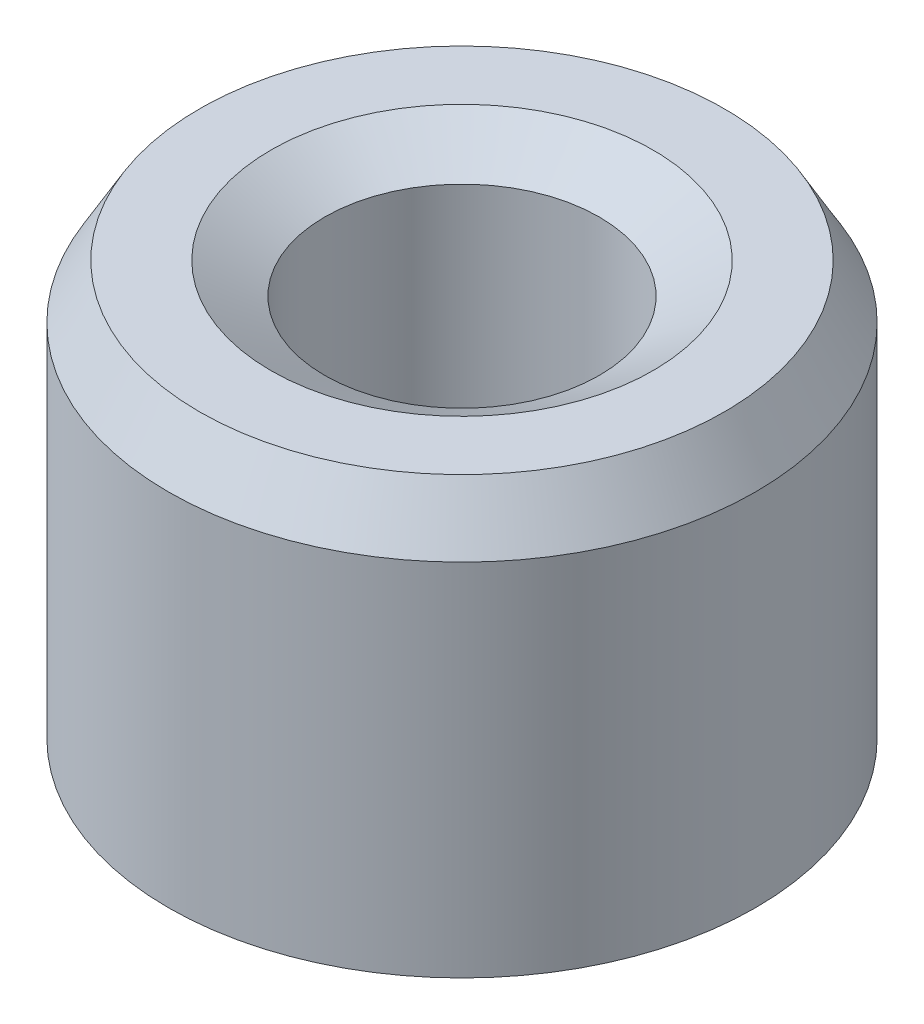
ISO-10303-21;
HEADER;
FILE_DESCRIPTION(('STEP AP214'),'2;1');
FILE_NAME('part.step','',(''),(''),'','','');
FILE_SCHEMA(('AUTOMOTIVE_DESIGN { 1 0 10303 214 1 1 1 1 }'));
ENDSEC;
DATA;
#1=APPLICATION_CONTEXT('core data for automotive mechanical design processes');
#2=APPLICATION_PROTOCOL_DEFINITION('international standard','automotive_design',2000,#1);
#3=PRODUCT_CONTEXT('',#1,'mechanical');
#4=PRODUCT('Part','Part','',(#3));
#5=PRODUCT_RELATED_PRODUCT_CATEGORY('part','',(#4));
#6=PRODUCT_DEFINITION_FORMATION('','',#4);
#7=PRODUCT_DEFINITION_CONTEXT('part definition',#1,'design');
#8=PRODUCT_DEFINITION('design','',#6,#7);
#9=PRODUCT_DEFINITION_SHAPE('','',#8);
#10=(LENGTH_UNIT() NAMED_UNIT(*) SI_UNIT(.MILLI.,.METRE.));
#11=(NAMED_UNIT(*) PLANE_ANGLE_UNIT() SI_UNIT($,.RADIAN.));
#12=(NAMED_UNIT(*) SI_UNIT($,.STERADIAN.) SOLID_ANGLE_UNIT());
#13=UNCERTAINTY_MEASURE_WITH_UNIT(LENGTH_MEASURE(1.E-05),#10,'distance_accuracy_value','');
#14=(GEOMETRIC_REPRESENTATION_CONTEXT(3) GLOBAL_UNCERTAINTY_ASSIGNED_CONTEXT((#13)) GLOBAL_UNIT_ASSIGNED_CONTEXT((#10,
#11,#12)) REPRESENTATION_CONTEXT('',''));
#15=CARTESIAN_POINT('',(0.,0.,0.));
#16=DIRECTION('',(0.,0.,1.));
#17=DIRECTION('',(1.,0.,0.));
#18=AXIS2_PLACEMENT_3D('',#15,#16,#17);
#19=CARTESIAN_POINT('',(0.,7.57981038934718,0.));
#20=DIRECTION('',(0.,-1.,0.));
#21=DIRECTION('',(0.,0.,-1.));
#22=AXIS2_PLACEMENT_3D('',#19,#20,#21);
#23=CYLINDRICAL_SURFACE('',#22,5.);
#24=CARTESIAN_POINT('',(0.,0.529280227483801,0.));
#25=DIRECTION('',(0.,1.,0.));
#26=DIRECTION('',(0.,0.,1.));
#27=AXIS2_PLACEMENT_3D('',#24,#25,#26);
#28=CIRCLE('',#27,5.);
#29=CARTESIAN_POINT('',(0.,0.529280227483801,5.));
#30=VERTEX_POINT('',#29);
#31=EDGE_CURVE('E10',#30,#30,#28,.T.);
#32=ORIENTED_EDGE('',*,*,#31,.T.);
#33=EDGE_LOOP('',(#32));
#34=FACE_BOUND('',#33,.T.);
#35=CARTESIAN_POINT('',(0.,6.66307014390361,0.));
#36=DIRECTION('',(0.,1.,0.));
#37=DIRECTION('',(0.,0.,1.));
#38=AXIS2_PLACEMENT_3D('',#35,#36,#37);
#39=CIRCLE('',#38,5.);
#40=CARTESIAN_POINT('',(0.,6.66307014390361,5.));
#41=VERTEX_POINT('',#40);
#42=EDGE_CURVE('E50',#41,#41,#39,.F.);
#43=ORIENTED_EDGE('',*,*,#42,.T.);
#44=EDGE_LOOP('',(#43));
#45=FACE_BOUND('',#44,.T.);
#46=ADVANCED_FACE('F39',(#34,#45),#23,.T.);
#47=CARTESIAN_POINT('',(0.,7.57981038934718,0.));
#48=DIRECTION('',(0.,1.,0.));
#49=DIRECTION('',(0.,0.,1.));
#50=AXIS2_PLACEMENT_3D('',#47,#48,#49);
#51=PLANE('',#50);
#52=CARTESIAN_POINT('',(0.,7.57981038934718,0.));
#53=DIRECTION('',(0.,1.,0.));
#54=DIRECTION('',(0.,0.,1.));
#55=AXIS2_PLACEMENT_3D('',#52,#53,#54);
#56=CIRCLE('',#55,3.25479358423829);
#57=CARTESIAN_POINT('',(0.,7.57981038934718,3.25479358423829));
#58=VERTEX_POINT('',#57);
#59=EDGE_CURVE('E58',#58,#58,#56,.F.);
#60=ORIENTED_EDGE('',*,*,#59,.T.);
#61=EDGE_LOOP('',(#60));
#62=FACE_BOUND('',#61,.T.);
#63=CARTESIAN_POINT('',(0.,7.57981038934718,0.));
#64=DIRECTION('',(0.,1.,0.));
#65=DIRECTION('',(0.,0.,1.));
#66=AXIS2_PLACEMENT_3D('',#63,#64,#65);
#67=CIRCLE('',#66,4.4707197725162);
#68=CARTESIAN_POINT('',(0.,7.57981038934718,4.4707197725162));
#69=VERTEX_POINT('',#68);
#70=EDGE_CURVE('E61',#69,#69,#67,.T.);
#71=ORIENTED_EDGE('',*,*,#70,.T.);
#72=EDGE_LOOP('',(#71));
#73=FACE_BOUND('',#72,.T.);
#74=ADVANCED_FACE('F88',(#62,#73),#51,.T.);
#75=CARTESIAN_POINT('',(0.,0.,0.));
#76=DIRECTION('',(0.,1.,0.));
#77=DIRECTION('',(0.,0.,1.));
#78=AXIS2_PLACEMENT_3D('',#75,#76,#77);
#79=PLANE('',#78);
#80=CARTESIAN_POINT('',(0.,0.,0.));
#81=DIRECTION('',(0.,1.,0.));
#82=DIRECTION('',(0.,0.,1.));
#83=AXIS2_PLACEMENT_3D('',#80,#81,#82);
#84=CIRCLE('',#83,2.86733356627853);
#85=CARTESIAN_POINT('',(0.,0.,2.86733356627853));
#86=VERTEX_POINT('',#85);
#87=EDGE_CURVE('E51',#86,#86,#84,.T.);
#88=ORIENTED_EDGE('',*,*,#87,.T.);
#89=EDGE_LOOP('',(#88));
#90=FACE_BOUND('',#89,.T.);
#91=CARTESIAN_POINT('',(0.,0.,0.));
#92=DIRECTION('',(0.,1.,0.));
#93=DIRECTION('',(0.,0.,1.));
#94=AXIS2_PLACEMENT_3D('',#91,#92,#93);
#95=CIRCLE('',#94,4.08325975455644);
#96=CARTESIAN_POINT('',(0.,0.,4.08325975455644));
#97=VERTEX_POINT('',#96);
#98=EDGE_CURVE('E54',#97,#97,#95,.F.);
#99=ORIENTED_EDGE('',*,*,#98,.T.);
#100=EDGE_LOOP('',(#99));
#101=FACE_BOUND('',#100,.T.);
#102=ADVANCED_FACE('F83',(#90,#101),#79,.F.);
#103=CARTESIAN_POINT('',(0.,7.57981038934718,0.));
#104=DIRECTION('',(0.,-1.,0.));
#105=DIRECTION('',(0.,0.,-1.));
#106=AXIS2_PLACEMENT_3D('',#103,#104,#105);
#107=CYLINDRICAL_SURFACE('',#106,2.33805333879473);
#108=CARTESIAN_POINT('',(0.,7.05053016186338,0.));
#109=DIRECTION('',(0.,1.,0.));
#110=DIRECTION('',(0.,0.,1.));
#111=AXIS2_PLACEMENT_3D('',#108,#109,#110);
#112=CIRCLE('',#111,2.33805333879473);
#113=CARTESIAN_POINT('',(0.,7.05053016186338,2.33805333879473));
#114=VERTEX_POINT('',#113);
#115=EDGE_CURVE('E67',#114,#114,#112,.T.);
#116=ORIENTED_EDGE('',*,*,#115,.T.);
#117=EDGE_LOOP('',(#116));
#118=FACE_BOUND('',#117,.T.);
#119=CARTESIAN_POINT('',(0.,0.916740245443558,0.));
#120=DIRECTION('',(0.,1.,0.));
#121=DIRECTION('',(0.,0.,1.));
#122=AXIS2_PLACEMENT_3D('',#119,#120,#121);
#123=CIRCLE('',#122,2.33805333879473);
#124=CARTESIAN_POINT('',(0.,0.916740245443558,2.33805333879473));
#125=VERTEX_POINT('',#124);
#126=EDGE_CURVE('E69',#125,#125,#123,.F.);
#127=ORIENTED_EDGE('',*,*,#126,.T.);
#128=EDGE_LOOP('',(#127));
#129=FACE_BOUND('',#128,.T.);
#130=ADVANCED_FACE('F71',(#118,#129),#107,.F.);
#131=CARTESIAN_POINT('',(0.,7.05053016186338,0.));
#132=DIRECTION('',(0.,1.,0.));
#133=DIRECTION('',(0.,0.,1.));
#134=AXIS2_PLACEMENT_3D('',#131,#132,#133);
#135=CONICAL_SURFACE('',#134,2.33805333879473,1.0471975511966);
#136=ORIENTED_EDGE('',*,*,#59,.F.);
#137=EDGE_LOOP('',(#136));
#138=FACE_BOUND('',#137,.T.);
#139=ORIENTED_EDGE('',*,*,#115,.F.);
#140=EDGE_LOOP('',(#139));
#141=FACE_BOUND('',#140,.T.);
#142=ADVANCED_FACE('F77',(#138,#141),#135,.F.);
#143=CARTESIAN_POINT('',(0.,0.,0.));
#144=DIRECTION('',(0.,-1.,0.));
#145=DIRECTION('',(0.,0.,-1.));
#146=AXIS2_PLACEMENT_3D('',#143,#144,#145);
#147=CONICAL_SURFACE('',#146,2.86733356627853,0.523598775598296);
#148=ORIENTED_EDGE('',*,*,#126,.F.);
#149=EDGE_LOOP('',(#148));
#150=FACE_BOUND('',#149,.T.);
#151=ORIENTED_EDGE('',*,*,#87,.F.);
#152=EDGE_LOOP('',(#151));
#153=FACE_BOUND('',#152,.T.);
#154=ADVANCED_FACE('F73',(#150,#153),#147,.F.);
#155=CARTESIAN_POINT('',(0.,0.529280227483801,0.));
#156=DIRECTION('',(0.,1.,0.));
#157=DIRECTION('',(0.,0.,1.));
#158=AXIS2_PLACEMENT_3D('',#155,#156,#157);
#159=CONICAL_SURFACE('',#158,5.,1.0471975511966);
#160=ORIENTED_EDGE('',*,*,#98,.F.);
#161=EDGE_LOOP('',(#160));
#162=FACE_BOUND('',#161,.T.);
#163=ORIENTED_EDGE('',*,*,#31,.F.);
#164=EDGE_LOOP('',(#163));
#165=FACE_BOUND('',#164,.T.);
#166=ADVANCED_FACE('F76',(#162,#165),#159,.T.);
#167=CARTESIAN_POINT('',(0.,7.57981038934718,0.));
#168=DIRECTION('',(0.,-1.,0.));
#169=DIRECTION('',(0.,0.,-1.));
#170=AXIS2_PLACEMENT_3D('',#167,#168,#169);
#171=CONICAL_SURFACE('',#170,4.4707197725162,0.523598775598295);
#172=ORIENTED_EDGE('',*,*,#42,.F.);
#173=EDGE_LOOP('',(#172));
#174=FACE_BOUND('',#173,.T.);
#175=ORIENTED_EDGE('',*,*,#70,.F.);
#176=EDGE_LOOP('',(#175));
#177=FACE_BOUND('',#176,.T.);
#178=ADVANCED_FACE('F45',(#174,#177),#171,.T.);
#179=CLOSED_SHELL('',(#46,#74,#102,#130,#142,#154,#166,#178));
#180=MANIFOLD_SOLID_BREP('B2',#179);
#181=ADVANCED_BREP_SHAPE_REPRESENTATION('',(#18,#180),#14);
#182=SHAPE_DEFINITION_REPRESENTATION(#9,#181);
ENDSEC;
END-ISO-10303-21;
